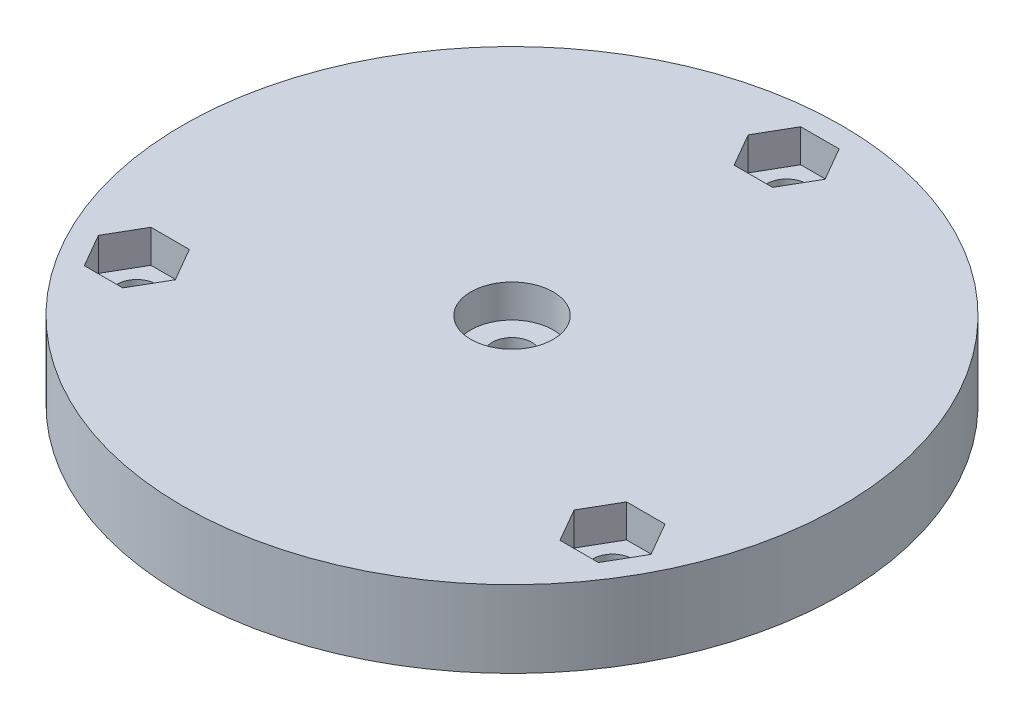
ISO-10303-21;
HEADER;
FILE_DESCRIPTION(('STEP AP214'),'2;1');
FILE_NAME('part.step','',(''),(''),'','','');
FILE_SCHEMA(('AUTOMOTIVE_DESIGN { 1 0 10303 214 1 1 1 1 }'));
ENDSEC;
DATA;
#1=APPLICATION_CONTEXT('core data for automotive mechanical design processes');
#2=APPLICATION_PROTOCOL_DEFINITION('international standard','automotive_design',2000,#1);
#3=PRODUCT_CONTEXT('',#1,'mechanical');
#4=PRODUCT('Part','Part','',(#3));
#5=PRODUCT_RELATED_PRODUCT_CATEGORY('part','',(#4));
#6=PRODUCT_DEFINITION_FORMATION('','',#4);
#7=PRODUCT_DEFINITION_CONTEXT('part definition',#1,'design');
#8=PRODUCT_DEFINITION('design','',#6,#7);
#9=PRODUCT_DEFINITION_SHAPE('','',#8);
#10=(LENGTH_UNIT() NAMED_UNIT(*) SI_UNIT(.MILLI.,.METRE.));
#11=(NAMED_UNIT(*) PLANE_ANGLE_UNIT() SI_UNIT($,.RADIAN.));
#12=(NAMED_UNIT(*) SI_UNIT($,.STERADIAN.) SOLID_ANGLE_UNIT());
#13=UNCERTAINTY_MEASURE_WITH_UNIT(LENGTH_MEASURE(1.E-05),#10,'distance_accuracy_value','');
#14=(GEOMETRIC_REPRESENTATION_CONTEXT(3) GLOBAL_UNCERTAINTY_ASSIGNED_CONTEXT((#13)) GLOBAL_UNIT_ASSIGNED_CONTEXT((#10,
#11,#12)) REPRESENTATION_CONTEXT('',''));
#15=CARTESIAN_POINT('',(0.,0.,0.));
#16=DIRECTION('',(0.,0.,1.));
#17=DIRECTION('',(1.,0.,0.));
#18=AXIS2_PLACEMENT_3D('',#15,#16,#17);
#19=CARTESIAN_POINT('',(0.,7.,0.));
#20=DIRECTION('',(0.,-1.,0.));
#21=DIRECTION('',(0.,0.,-1.));
#22=AXIS2_PLACEMENT_3D('',#19,#20,#21);
#23=CYLINDRICAL_SURFACE('',#22,1.8);
#24=CARTESIAN_POINT('',(0.,0.,0.));
#25=DIRECTION('',(0.,1.,0.));
#26=DIRECTION('',(0.,0.,1.));
#27=AXIS2_PLACEMENT_3D('',#24,#25,#26);
#28=CIRCLE('',#27,1.8);
#29=CARTESIAN_POINT('',(0.,0.,1.8));
#30=VERTEX_POINT('',#29);
#31=EDGE_CURVE('E377',#30,#30,#28,.T.);
#32=ORIENTED_EDGE('',*,*,#31,.F.);
#33=EDGE_LOOP('',(#32));
#34=FACE_BOUND('',#33,.T.);
#35=CARTESIAN_POINT('',(0.,4.,0.));
#36=DIRECTION('',(0.,1.,0.));
#37=DIRECTION('',(0.,0.,1.));
#38=AXIS2_PLACEMENT_3D('',#35,#36,#37);
#39=CIRCLE('',#38,1.8);
#40=CARTESIAN_POINT('',(0.,4.,1.8));
#41=VERTEX_POINT('',#40);
#42=EDGE_CURVE('E47',#41,#41,#39,.T.);
#43=ORIENTED_EDGE('',*,*,#42,.T.);
#44=EDGE_LOOP('',(#43));
#45=FACE_BOUND('',#44,.T.);
#46=ADVANCED_FACE('F43',(#34,#45),#23,.F.);
#47=CARTESIAN_POINT('',(0.,7.,-25.));
#48=DIRECTION('',(0.,-1.,0.));
#49=DIRECTION('',(0.,0.,-1.));
#50=AXIS2_PLACEMENT_3D('',#47,#48,#49);
#51=CYLINDRICAL_SURFACE('',#50,1.8);
#52=CARTESIAN_POINT('',(0.,0.,-25.));
#53=DIRECTION('',(0.,1.,0.));
#54=DIRECTION('',(0.,0.,1.));
#55=AXIS2_PLACEMENT_3D('',#52,#53,#54);
#56=CIRCLE('',#55,1.8);
#57=CARTESIAN_POINT('',(0.,0.,-23.2));
#58=VERTEX_POINT('',#57);
#59=EDGE_CURVE('E373',#58,#58,#56,.T.);
#60=ORIENTED_EDGE('',*,*,#59,.F.);
#61=EDGE_LOOP('',(#60));
#62=FACE_BOUND('',#61,.T.);
#63=CARTESIAN_POINT('',(0.,4.,-25.));
#64=DIRECTION('',(0.,1.,0.));
#65=DIRECTION('',(0.,0.,1.));
#66=AXIS2_PLACEMENT_3D('',#63,#64,#65);
#67=CIRCLE('',#66,1.8);
#68=CARTESIAN_POINT('',(0.,4.,-23.2));
#69=VERTEX_POINT('',#68);
#70=EDGE_CURVE('E390',#69,#69,#67,.T.);
#71=ORIENTED_EDGE('',*,*,#70,.T.);
#72=EDGE_LOOP('',(#71));
#73=FACE_BOUND('',#72,.T.);
#74=ADVANCED_FACE('F500',(#62,#73),#51,.F.);
#75=CARTESIAN_POINT('',(21.650635094611,7.,12.5));
#76=DIRECTION('',(0.,-1.,0.));
#77=DIRECTION('',(0.,0.,-1.));
#78=AXIS2_PLACEMENT_3D('',#75,#76,#77);
#79=CYLINDRICAL_SURFACE('',#78,1.8);
#80=CARTESIAN_POINT('',(21.650635094611,0.,12.5));
#81=DIRECTION('',(0.,1.,0.));
#82=DIRECTION('',(0.,0.,1.));
#83=AXIS2_PLACEMENT_3D('',#80,#81,#82);
#84=CIRCLE('',#83,1.8);
#85=CARTESIAN_POINT('',(21.650635094611,0.,14.3));
#86=VERTEX_POINT('',#85);
#87=EDGE_CURVE('E369',#86,#86,#84,.T.);
#88=ORIENTED_EDGE('',*,*,#87,.F.);
#89=EDGE_LOOP('',(#88));
#90=FACE_BOUND('',#89,.T.);
#91=CARTESIAN_POINT('',(21.650635094611,4.,12.5));
#92=DIRECTION('',(0.,1.,0.));
#93=DIRECTION('',(0.,0.,1.));
#94=AXIS2_PLACEMENT_3D('',#91,#92,#93);
#95=CIRCLE('',#94,1.8);
#96=CARTESIAN_POINT('',(21.650635094611,4.,14.3));
#97=VERTEX_POINT('',#96);
#98=EDGE_CURVE('E387',#97,#97,#95,.T.);
#99=ORIENTED_EDGE('',*,*,#98,.T.);
#100=EDGE_LOOP('',(#99));
#101=FACE_BOUND('',#100,.T.);
#102=ADVANCED_FACE('F437',(#90,#101),#79,.F.);
#103=CARTESIAN_POINT('',(-21.650635094611,7.,12.5));
#104=DIRECTION('',(0.,-1.,0.));
#105=DIRECTION('',(0.,0.,-1.));
#106=AXIS2_PLACEMENT_3D('',#103,#104,#105);
#107=CYLINDRICAL_SURFACE('',#106,1.8);
#108=CARTESIAN_POINT('',(-21.650635094611,0.,12.5));
#109=DIRECTION('',(0.,1.,0.));
#110=DIRECTION('',(0.,0.,1.));
#111=AXIS2_PLACEMENT_3D('',#108,#109,#110);
#112=CIRCLE('',#111,1.8);
#113=CARTESIAN_POINT('',(-21.650635094611,0.,14.3));
#114=VERTEX_POINT('',#113);
#115=EDGE_CURVE('E365',#114,#114,#112,.T.);
#116=ORIENTED_EDGE('',*,*,#115,.F.);
#117=EDGE_LOOP('',(#116));
#118=FACE_BOUND('',#117,.T.);
#119=CARTESIAN_POINT('',(-21.650635094611,4.,12.5));
#120=DIRECTION('',(0.,1.,0.));
#121=DIRECTION('',(0.,0.,1.));
#122=AXIS2_PLACEMENT_3D('',#119,#120,#121);
#123=CIRCLE('',#122,1.8);
#124=CARTESIAN_POINT('',(-21.650635094611,4.,14.3));
#125=VERTEX_POINT('',#124);
#126=EDGE_CURVE('E363',#125,#125,#123,.T.);
#127=ORIENTED_EDGE('',*,*,#126,.T.);
#128=EDGE_LOOP('',(#127));
#129=FACE_BOUND('',#128,.T.);
#130=ADVANCED_FACE('F415',(#118,#129),#107,.F.);
#131=CARTESIAN_POINT('',(0.,7.,0.));
#132=DIRECTION('',(0.,1.,0.));
#133=DIRECTION('',(0.,0.,1.));
#134=AXIS2_PLACEMENT_3D('',#131,#132,#133);
#135=PLANE('',#134);
#136=DIRECTION('',(-1.,0.,0.));
#137=VECTOR('',#136,1.);
#138=CARTESIAN_POINT('',(-19.900635094611,7.,9.46891108675447));
#139=LINE('',#138,#137);
#140=CARTESIAN_POINT('',(-19.900635094611,7.,9.46891108675447));
#141=VERTEX_POINT('',#140);
#142=CARTESIAN_POINT('',(-23.400635094611,7.,9.46891108675448));
#143=VERTEX_POINT('',#142);
#144=EDGE_CURVE('E61',#141,#143,#139,.T.);
#145=ORIENTED_EDGE('',*,*,#144,.F.);
#146=DIRECTION('',(-0.5,0.,-0.866025403784438));
#147=VECTOR('',#146,1.);
#148=CARTESIAN_POINT('',(-18.150635094611,7.,12.5));
#149=LINE('',#148,#147);
#150=CARTESIAN_POINT('',(-18.150635094611,7.,12.5));
#151=VERTEX_POINT('',#150);
#152=EDGE_CURVE('E316',#151,#141,#149,.T.);
#153=ORIENTED_EDGE('',*,*,#152,.F.);
#154=DIRECTION('',(0.5,0.,-0.866025403784439));
#155=VECTOR('',#154,1.);
#156=CARTESIAN_POINT('',(-19.900635094611,7.,15.5310889132456));
#157=LINE('',#156,#155);
#158=CARTESIAN_POINT('',(-19.900635094611,7.,15.5310889132456));
#159=VERTEX_POINT('',#158);
#160=EDGE_CURVE('E320',#159,#151,#157,.T.);
#161=ORIENTED_EDGE('',*,*,#160,.F.);
#162=DIRECTION('',(1.,0.,0.));
#163=VECTOR('',#162,1.);
#164=CARTESIAN_POINT('',(-23.400635094611,7.,15.5310889132456));
#165=LINE('',#164,#163);
#166=CARTESIAN_POINT('',(-23.400635094611,7.,15.5310889132456));
#167=VERTEX_POINT('',#166);
#168=EDGE_CURVE('E325',#167,#159,#165,.T.);
#169=ORIENTED_EDGE('',*,*,#168,.F.);
#170=DIRECTION('',(0.5,0.,0.866025403784439));
#171=VECTOR('',#170,1.);
#172=CARTESIAN_POINT('',(-25.150635094611,7.,12.5));
#173=LINE('',#172,#171);
#174=CARTESIAN_POINT('',(-25.150635094611,7.,12.5));
#175=VERTEX_POINT('',#174);
#176=EDGE_CURVE('E329',#175,#167,#173,.T.);
#177=ORIENTED_EDGE('',*,*,#176,.F.);
#178=DIRECTION('',(-0.5,0.,0.866025403784439));
#179=VECTOR('',#178,1.);
#180=CARTESIAN_POINT('',(-23.400635094611,7.,9.46891108675447));
#181=LINE('',#180,#179);
#182=EDGE_CURVE('E333',#143,#175,#181,.T.);
#183=ORIENTED_EDGE('',*,*,#182,.F.);
#184=EDGE_LOOP('',(#145,#153,#161,#169,#177,#183));
#185=FACE_BOUND('',#184,.T.);
#186=DIRECTION('',(0.500000000000001,0.,0.866025403784438));
#187=VECTOR('',#186,1.);
#188=CARTESIAN_POINT('',(18.150635094611,7.,12.5));
#189=LINE('',#188,#187);
#190=CARTESIAN_POINT('',(18.150635094611,7.,12.5));
#191=VERTEX_POINT('',#190);
#192=CARTESIAN_POINT('',(19.900635094611,7.,15.5310889132455));
#193=VERTEX_POINT('',#192);
#194=EDGE_CURVE('E69',#191,#193,#189,.T.);
#195=ORIENTED_EDGE('',*,*,#194,.F.);
#196=DIRECTION('',(-0.5,0.,0.866025403784439));
#197=VECTOR('',#196,1.);
#198=CARTESIAN_POINT('',(19.900635094611,7.,9.46891108675445));
#199=LINE('',#198,#197);
#200=CARTESIAN_POINT('',(19.900635094611,7.,9.46891108675445));
#201=VERTEX_POINT('',#200);
#202=EDGE_CURVE('E252',#201,#191,#199,.T.);
#203=ORIENTED_EDGE('',*,*,#202,.F.);
#204=DIRECTION('',(-1.,0.,0.));
#205=VECTOR('',#204,1.);
#206=CARTESIAN_POINT('',(23.400635094611,7.,9.46891108675445));
#207=LINE('',#206,#205);
#208=CARTESIAN_POINT('',(23.400635094611,7.,9.46891108675445));
#209=VERTEX_POINT('',#208);
#210=EDGE_CURVE('E256',#209,#201,#207,.T.);
#211=ORIENTED_EDGE('',*,*,#210,.F.);
#212=DIRECTION('',(-0.5,0.,-0.866025403784439));
#213=VECTOR('',#212,1.);
#214=CARTESIAN_POINT('',(25.150635094611,7.,12.5));
#215=LINE('',#214,#213);
#216=CARTESIAN_POINT('',(25.150635094611,7.,12.5));
#217=VERTEX_POINT('',#216);
#218=EDGE_CURVE('E261',#217,#209,#215,.T.);
#219=ORIENTED_EDGE('',*,*,#218,.F.);
#220=DIRECTION('',(0.5,0.,-0.866025403784438));
#221=VECTOR('',#220,1.);
#222=CARTESIAN_POINT('',(23.400635094611,7.,15.5310889132455));
#223=LINE('',#222,#221);
#224=CARTESIAN_POINT('',(23.400635094611,7.,15.5310889132455));
#225=VERTEX_POINT('',#224);
#226=EDGE_CURVE('E265',#225,#217,#223,.T.);
#227=ORIENTED_EDGE('',*,*,#226,.F.);
#228=DIRECTION('',(1.,0.,0.));
#229=VECTOR('',#228,1.);
#230=CARTESIAN_POINT('',(19.900635094611,7.,15.5310889132455));
#231=LINE('',#230,#229);
#232=EDGE_CURVE('E269',#193,#225,#231,.T.);
#233=ORIENTED_EDGE('',*,*,#232,.F.);
#234=EDGE_LOOP('',(#195,#203,#211,#219,#227,#233));
#235=FACE_BOUND('',#234,.T.);
#236=DIRECTION('',(0.5,0.,-0.866025403784438));
#237=VECTOR('',#236,1.);
#238=CARTESIAN_POINT('',(1.75,7.,-21.9689110867545));
#239=LINE('',#238,#237);
#240=CARTESIAN_POINT('',(1.75,7.,-21.9689110867545));
#241=VERTEX_POINT('',#240);
#242=CARTESIAN_POINT('',(3.50000000000001,7.,-25.));
#243=VERTEX_POINT('',#242);
#244=EDGE_CURVE('E174',#241,#243,#239,.T.);
#245=ORIENTED_EDGE('',*,*,#244,.F.);
#246=DIRECTION('',(1.,0.,0.));
#247=VECTOR('',#246,1.);
#248=CARTESIAN_POINT('',(-1.75000000000001,7.,-21.9689110867545));
#249=LINE('',#248,#247);
#250=CARTESIAN_POINT('',(-1.75000000000001,7.,-21.9689110867545));
#251=VERTEX_POINT('',#250);
#252=EDGE_CURVE('E185',#251,#241,#249,.T.);
#253=ORIENTED_EDGE('',*,*,#252,.F.);
#254=DIRECTION('',(0.5,0.,0.866025403784439));
#255=VECTOR('',#254,1.);
#256=CARTESIAN_POINT('',(-3.50000000000001,7.,-25.));
#257=LINE('',#256,#255);
#258=CARTESIAN_POINT('',(-3.50000000000001,7.,-25.));
#259=VERTEX_POINT('',#258);
#260=EDGE_CURVE('E191',#259,#251,#257,.T.);
#261=ORIENTED_EDGE('',*,*,#260,.F.);
#262=DIRECTION('',(-0.5,0.,0.866025403784439));
#263=VECTOR('',#262,1.);
#264=CARTESIAN_POINT('',(-1.75000000000001,7.,-28.0310889132455));
#265=LINE('',#264,#263);
#266=CARTESIAN_POINT('',(-1.75000000000001,7.,-28.0310889132455));
#267=VERTEX_POINT('',#266);
#268=EDGE_CURVE('E806',#267,#259,#265,.T.);
#269=ORIENTED_EDGE('',*,*,#268,.F.);
#270=DIRECTION('',(-1.,0.,0.));
#271=VECTOR('',#270,1.);
#272=CARTESIAN_POINT('',(1.75,7.,-28.0310889132455));
#273=LINE('',#272,#271);
#274=CARTESIAN_POINT('',(1.75,7.,-28.0310889132455));
#275=VERTEX_POINT('',#274);
#276=EDGE_CURVE('E207',#275,#267,#273,.T.);
#277=ORIENTED_EDGE('',*,*,#276,.F.);
#278=DIRECTION('',(-0.5,0.,-0.866025403784438));
#279=VECTOR('',#278,1.);
#280=CARTESIAN_POINT('',(3.5,7.,-25.));
#281=LINE('',#280,#279);
#282=EDGE_CURVE('E198',#243,#275,#281,.T.);
#283=ORIENTED_EDGE('',*,*,#282,.F.);
#284=EDGE_LOOP('',(#245,#253,#261,#269,#277,#283));
#285=FACE_BOUND('',#284,.T.);
#286=CARTESIAN_POINT('',(0.,7.,0.));
#287=DIRECTION('',(0.,1.,0.));
#288=DIRECTION('',(0.,0.,1.));
#289=AXIS2_PLACEMENT_3D('',#286,#287,#288);
#290=CIRCLE('',#289,3.75);
#291=CARTESIAN_POINT('',(0.,7.,3.75));
#292=VERTEX_POINT('',#291);
#293=EDGE_CURVE('E200',#292,#292,#290,.T.);
#294=ORIENTED_EDGE('',*,*,#293,.F.);
#295=EDGE_LOOP('',(#294));
#296=FACE_BOUND('',#295,.T.);
#297=CARTESIAN_POINT('',(0.,7.,0.));
#298=DIRECTION('',(0.,1.,0.));
#299=DIRECTION('',(0.,0.,1.));
#300=AXIS2_PLACEMENT_3D('',#297,#298,#299);
#301=CIRCLE('',#300,30.);
#302=CARTESIAN_POINT('',(0.,7.,30.));
#303=VERTEX_POINT('',#302);
#304=EDGE_CURVE('E11',#303,#303,#301,.T.);
#305=ORIENTED_EDGE('',*,*,#304,.T.);
#306=EDGE_LOOP('',(#305));
#307=FACE_BOUND('',#306,.T.);
#308=ADVANCED_FACE('F194',(#185,#235,#285,#296,#307),#135,.T.);
#309=CARTESIAN_POINT('',(0.,0.,0.));
#310=DIRECTION('',(0.,1.,0.));
#311=DIRECTION('',(0.,0.,1.));
#312=AXIS2_PLACEMENT_3D('',#309,#310,#311);
#313=PLANE('',#312);
#314=CARTESIAN_POINT('',(0.,0.,0.));
#315=DIRECTION('',(0.,1.,0.));
#316=DIRECTION('',(0.,0.,1.));
#317=AXIS2_PLACEMENT_3D('',#314,#315,#316);
#318=CIRCLE('',#317,30.);
#319=CARTESIAN_POINT('',(0.,0.,30.));
#320=VERTEX_POINT('',#319);
#321=EDGE_CURVE('E53',#320,#320,#318,.T.);
#322=ORIENTED_EDGE('',*,*,#321,.F.);
#323=EDGE_LOOP('',(#322));
#324=FACE_BOUND('',#323,.T.);
#325=ORIENTED_EDGE('',*,*,#31,.T.);
#326=EDGE_LOOP('',(#325));
#327=FACE_BOUND('',#326,.T.);
#328=ORIENTED_EDGE('',*,*,#59,.T.);
#329=EDGE_LOOP('',(#328));
#330=FACE_BOUND('',#329,.T.);
#331=ORIENTED_EDGE('',*,*,#87,.T.);
#332=EDGE_LOOP('',(#331));
#333=FACE_BOUND('',#332,.T.);
#334=ORIENTED_EDGE('',*,*,#115,.T.);
#335=EDGE_LOOP('',(#334));
#336=FACE_BOUND('',#335,.T.);
#337=ADVANCED_FACE('F414',(#324,#327,#330,#333,#336),#313,.F.);
#338=CARTESIAN_POINT('',(0.,7.,0.));
#339=DIRECTION('',(0.,-1.,0.));
#340=DIRECTION('',(0.,0.,-1.));
#341=AXIS2_PLACEMENT_3D('',#338,#339,#340);
#342=CYLINDRICAL_SURFACE('',#341,30.);
#343=ORIENTED_EDGE('',*,*,#304,.F.);
#344=EDGE_LOOP('',(#343));
#345=FACE_BOUND('',#344,.T.);
#346=ORIENTED_EDGE('',*,*,#321,.T.);
#347=EDGE_LOOP('',(#346));
#348=FACE_BOUND('',#347,.T.);
#349=ADVANCED_FACE('F45',(#345,#348),#342,.T.);
#350=CARTESIAN_POINT('',(-19.900635094611,4.,9.46891108675447));
#351=DIRECTION('',(0.,0.,-1.));
#352=DIRECTION('',(-1.,0.,0.));
#353=AXIS2_PLACEMENT_3D('',#350,#351,#352);
#354=PLANE('',#353);
#355=ORIENTED_EDGE('',*,*,#144,.T.);
#356=DIRECTION('',(0.,1.,0.));
#357=VECTOR('',#356,1.);
#358=CARTESIAN_POINT('',(-23.400635094611,4.,9.46891108675447));
#359=LINE('',#358,#357);
#360=CARTESIAN_POINT('',(-23.400635094611,4.,9.46891108675447));
#361=VERTEX_POINT('',#360);
#362=EDGE_CURVE('E297',#361,#143,#359,.T.);
#363=ORIENTED_EDGE('',*,*,#362,.F.);
#364=DIRECTION('',(-1.,0.,0.));
#365=VECTOR('',#364,1.);
#366=CARTESIAN_POINT('',(-19.900635094611,4.,9.46891108675447));
#367=LINE('',#366,#365);
#368=CARTESIAN_POINT('',(-19.900635094611,4.,9.46891108675447));
#369=VERTEX_POINT('',#368);
#370=EDGE_CURVE('E321',#369,#361,#367,.T.);
#371=ORIENTED_EDGE('',*,*,#370,.F.);
#372=DIRECTION('',(0.,1.,0.));
#373=VECTOR('',#372,1.);
#374=CARTESIAN_POINT('',(-19.900635094611,4.,9.46891108675447));
#375=LINE('',#374,#373);
#376=EDGE_CURVE('E313',#369,#141,#375,.T.);
#377=ORIENTED_EDGE('',*,*,#376,.T.);
#378=EDGE_LOOP('',(#355,#363,#371,#377));
#379=FACE_BOUND('',#378,.T.);
#380=ADVANCED_FACE('F422',(#379),#354,.F.);
#381=CARTESIAN_POINT('',(-18.150635094611,4.,12.5));
#382=DIRECTION('',(0.866025403784438,0.,-0.5));
#383=DIRECTION('',(-0.5,0.,-0.866025403784439));
#384=AXIS2_PLACEMENT_3D('',#381,#382,#383);
#385=PLANE('',#384);
#386=ORIENTED_EDGE('',*,*,#152,.T.);
#387=ORIENTED_EDGE('',*,*,#376,.F.);
#388=DIRECTION('',(-0.5,0.,-0.866025403784438));
#389=VECTOR('',#388,1.);
#390=CARTESIAN_POINT('',(-18.150635094611,4.,12.5));
#391=LINE('',#390,#389);
#392=CARTESIAN_POINT('',(-18.150635094611,4.,12.5));
#393=VERTEX_POINT('',#392);
#394=EDGE_CURVE('E300',#393,#369,#391,.T.);
#395=ORIENTED_EDGE('',*,*,#394,.F.);
#396=DIRECTION('',(0.,1.,0.));
#397=VECTOR('',#396,1.);
#398=CARTESIAN_POINT('',(-18.150635094611,4.,12.5));
#399=LINE('',#398,#397);
#400=EDGE_CURVE('E310',#393,#151,#399,.T.);
#401=ORIENTED_EDGE('',*,*,#400,.T.);
#402=EDGE_LOOP('',(#386,#387,#395,#401));
#403=FACE_BOUND('',#402,.T.);
#404=ADVANCED_FACE('F466',(#403),#385,.F.);
#405=CARTESIAN_POINT('',(-19.900635094611,4.,15.5310889132456));
#406=DIRECTION('',(0.866025403784439,0.,0.5));
#407=DIRECTION('',(0.5,0.,-0.866025403784439));
#408=AXIS2_PLACEMENT_3D('',#405,#406,#407);
#409=PLANE('',#408);
#410=ORIENTED_EDGE('',*,*,#160,.T.);
#411=ORIENTED_EDGE('',*,*,#400,.F.);
#412=DIRECTION('',(0.5,0.,-0.866025403784439));
#413=VECTOR('',#412,1.);
#414=CARTESIAN_POINT('',(-19.900635094611,4.,15.5310889132456));
#415=LINE('',#414,#413);
#416=CARTESIAN_POINT('',(-19.900635094611,4.,15.5310889132456));
#417=VERTEX_POINT('',#416);
#418=EDGE_CURVE('E342',#417,#393,#415,.T.);
#419=ORIENTED_EDGE('',*,*,#418,.F.);
#420=DIRECTION('',(0.,1.,0.));
#421=VECTOR('',#420,1.);
#422=CARTESIAN_POINT('',(-19.900635094611,4.,15.5310889132456));
#423=LINE('',#422,#421);
#424=EDGE_CURVE('E307',#417,#159,#423,.T.);
#425=ORIENTED_EDGE('',*,*,#424,.T.);
#426=EDGE_LOOP('',(#410,#411,#419,#425));
#427=FACE_BOUND('',#426,.T.);
#428=ADVANCED_FACE('F463',(#427),#409,.F.);
#429=CARTESIAN_POINT('',(-23.400635094611,4.,15.5310889132456));
#430=DIRECTION('',(0.,0.,1.));
#431=DIRECTION('',(1.,0.,0.));
#432=AXIS2_PLACEMENT_3D('',#429,#430,#431);
#433=PLANE('',#432);
#434=ORIENTED_EDGE('',*,*,#168,.T.);
#435=ORIENTED_EDGE('',*,*,#424,.F.);
#436=DIRECTION('',(1.,0.,0.));
#437=VECTOR('',#436,1.);
#438=CARTESIAN_POINT('',(-23.400635094611,4.,15.5310889132456));
#439=LINE('',#438,#437);
#440=CARTESIAN_POINT('',(-23.400635094611,4.,15.5310889132456));
#441=VERTEX_POINT('',#440);
#442=EDGE_CURVE('E346',#441,#417,#439,.T.);
#443=ORIENTED_EDGE('',*,*,#442,.F.);
#444=DIRECTION('',(0.,1.,0.));
#445=VECTOR('',#444,1.);
#446=CARTESIAN_POINT('',(-23.400635094611,4.,15.5310889132456));
#447=LINE('',#446,#445);
#448=EDGE_CURVE('E304',#441,#167,#447,.T.);
#449=ORIENTED_EDGE('',*,*,#448,.T.);
#450=EDGE_LOOP('',(#434,#435,#443,#449));
#451=FACE_BOUND('',#450,.T.);
#452=ADVANCED_FACE('F459',(#451),#433,.F.);
#453=CARTESIAN_POINT('',(-25.150635094611,4.,12.5));
#454=DIRECTION('',(-0.866025403784439,0.,0.5));
#455=DIRECTION('',(0.5,0.,0.866025403784439));
#456=AXIS2_PLACEMENT_3D('',#453,#454,#455);
#457=PLANE('',#456);
#458=ORIENTED_EDGE('',*,*,#176,.T.);
#459=ORIENTED_EDGE('',*,*,#448,.F.);
#460=DIRECTION('',(0.5,0.,0.866025403784439));
#461=VECTOR('',#460,1.);
#462=CARTESIAN_POINT('',(-25.150635094611,4.,12.5));
#463=LINE('',#462,#461);
#464=CARTESIAN_POINT('',(-25.150635094611,4.,12.5));
#465=VERTEX_POINT('',#464);
#466=EDGE_CURVE('E350',#465,#441,#463,.T.);
#467=ORIENTED_EDGE('',*,*,#466,.F.);
#468=DIRECTION('',(0.,1.,0.));
#469=VECTOR('',#468,1.);
#470=CARTESIAN_POINT('',(-25.150635094611,4.,12.5));
#471=LINE('',#470,#469);
#472=EDGE_CURVE('E301',#465,#175,#471,.T.);
#473=ORIENTED_EDGE('',*,*,#472,.T.);
#474=EDGE_LOOP('',(#458,#459,#467,#473));
#475=FACE_BOUND('',#474,.T.);
#476=ADVANCED_FACE('F455',(#475),#457,.F.);
#477=CARTESIAN_POINT('',(-23.400635094611,4.,9.46891108675447));
#478=DIRECTION('',(-0.866025403784439,0.,-0.5));
#479=DIRECTION('',(-0.5,0.,0.866025403784439));
#480=AXIS2_PLACEMENT_3D('',#477,#478,#479);
#481=PLANE('',#480);
#482=ORIENTED_EDGE('',*,*,#182,.T.);
#483=ORIENTED_EDGE('',*,*,#472,.F.);
#484=DIRECTION('',(-0.5,0.,0.866025403784439));
#485=VECTOR('',#484,1.);
#486=CARTESIAN_POINT('',(-23.400635094611,4.,9.46891108675447));
#487=LINE('',#486,#485);
#488=EDGE_CURVE('E354',#361,#465,#487,.T.);
#489=ORIENTED_EDGE('',*,*,#488,.F.);
#490=ORIENTED_EDGE('',*,*,#362,.T.);
#491=EDGE_LOOP('',(#482,#483,#489,#490));
#492=FACE_BOUND('',#491,.T.);
#493=ADVANCED_FACE('F445',(#492),#481,.F.);
#494=CARTESIAN_POINT('',(0.,4.,0.));
#495=DIRECTION('',(0.,1.,0.));
#496=DIRECTION('',(0.,0.,1.));
#497=AXIS2_PLACEMENT_3D('',#494,#495,#496);
#498=PLANE('',#497);
#499=ORIENTED_EDGE('',*,*,#126,.F.);
#500=EDGE_LOOP('',(#499));
#501=FACE_BOUND('',#500,.T.);
#502=ORIENTED_EDGE('',*,*,#370,.T.);
#503=ORIENTED_EDGE('',*,*,#488,.T.);
#504=ORIENTED_EDGE('',*,*,#466,.T.);
#505=ORIENTED_EDGE('',*,*,#442,.T.);
#506=ORIENTED_EDGE('',*,*,#418,.T.);
#507=ORIENTED_EDGE('',*,*,#394,.T.);
#508=EDGE_LOOP('',(#502,#503,#504,#505,#506,#507));
#509=FACE_BOUND('',#508,.T.);
#510=ADVANCED_FACE('F441',(#501,#509),#498,.T.);
#511=CARTESIAN_POINT('',(18.150635094611,4.,12.5));
#512=DIRECTION('',(-0.866025403784438,0.,0.500000000000001));
#513=DIRECTION('',(0.500000000000001,0.,0.866025403784438));
#514=AXIS2_PLACEMENT_3D('',#511,#512,#513);
#515=PLANE('',#514);
#516=ORIENTED_EDGE('',*,*,#194,.T.);
#517=DIRECTION('',(0.,1.,0.));
#518=VECTOR('',#517,1.);
#519=CARTESIAN_POINT('',(19.900635094611,4.,15.5310889132455));
#520=LINE('',#519,#518);
#521=CARTESIAN_POINT('',(19.900635094611,4.,15.5310889132455));
#522=VERTEX_POINT('',#521);
#523=EDGE_CURVE('E233',#522,#193,#520,.T.);
#524=ORIENTED_EDGE('',*,*,#523,.F.);
#525=DIRECTION('',(0.500000000000001,0.,0.866025403784438));
#526=VECTOR('',#525,1.);
#527=CARTESIAN_POINT('',(18.150635094611,4.,12.5));
#528=LINE('',#527,#526);
#529=CARTESIAN_POINT('',(18.150635094611,4.,12.5));
#530=VERTEX_POINT('',#529);
#531=EDGE_CURVE('E257',#530,#522,#528,.T.);
#532=ORIENTED_EDGE('',*,*,#531,.F.);
#533=DIRECTION('',(0.,1.,0.));
#534=VECTOR('',#533,1.);
#535=CARTESIAN_POINT('',(18.150635094611,4.,12.5));
#536=LINE('',#535,#534);
#537=EDGE_CURVE('E249',#530,#191,#536,.T.);
#538=ORIENTED_EDGE('',*,*,#537,.T.);
#539=EDGE_LOOP('',(#516,#524,#532,#538));
#540=FACE_BOUND('',#539,.T.);
#541=ADVANCED_FACE('F444',(#540),#515,.F.);
#542=CARTESIAN_POINT('',(19.900635094611,4.,9.46891108675445));
#543=DIRECTION('',(-0.866025403784438,0.,-0.5));
#544=DIRECTION('',(-0.5,0.,0.866025403784439));
#545=AXIS2_PLACEMENT_3D('',#542,#543,#544);
#546=PLANE('',#545);
#547=ORIENTED_EDGE('',*,*,#202,.T.);
#548=ORIENTED_EDGE('',*,*,#537,.F.);
#549=DIRECTION('',(-0.5,0.,0.866025403784439));
#550=VECTOR('',#549,1.);
#551=CARTESIAN_POINT('',(19.900635094611,4.,9.46891108675445));
#552=LINE('',#551,#550);
#553=CARTESIAN_POINT('',(19.900635094611,4.,9.46891108675445));
#554=VERTEX_POINT('',#553);
#555=EDGE_CURVE('E236',#554,#530,#552,.T.);
#556=ORIENTED_EDGE('',*,*,#555,.F.);
#557=DIRECTION('',(0.,1.,0.));
#558=VECTOR('',#557,1.);
#559=CARTESIAN_POINT('',(19.900635094611,4.,9.46891108675445));
#560=LINE('',#559,#558);
#561=EDGE_CURVE('E246',#554,#201,#560,.T.);
#562=ORIENTED_EDGE('',*,*,#561,.T.);
#563=EDGE_LOOP('',(#547,#548,#556,#562));
#564=FACE_BOUND('',#563,.T.);
#565=ADVANCED_FACE('F483',(#564),#546,.F.);
#566=CARTESIAN_POINT('',(23.400635094611,4.,9.46891108675445));
#567=DIRECTION('',(0.,0.,-1.));
#568=DIRECTION('',(-1.,0.,0.));
#569=AXIS2_PLACEMENT_3D('',#566,#567,#568);
#570=PLANE('',#569);
#571=ORIENTED_EDGE('',*,*,#210,.T.);
#572=ORIENTED_EDGE('',*,*,#561,.F.);
#573=DIRECTION('',(-1.,0.,0.));
#574=VECTOR('',#573,1.);
#575=CARTESIAN_POINT('',(23.400635094611,4.,9.46891108675445));
#576=LINE('',#575,#574);
#577=CARTESIAN_POINT('',(23.400635094611,4.,9.46891108675445));
#578=VERTEX_POINT('',#577);
#579=EDGE_CURVE('E278',#578,#554,#576,.T.);
#580=ORIENTED_EDGE('',*,*,#579,.F.);
#581=DIRECTION('',(0.,1.,0.));
#582=VECTOR('',#581,1.);
#583=CARTESIAN_POINT('',(23.400635094611,4.,9.46891108675445));
#584=LINE('',#583,#582);
#585=EDGE_CURVE('E243',#578,#209,#584,.T.);
#586=ORIENTED_EDGE('',*,*,#585,.T.);
#587=EDGE_LOOP('',(#571,#572,#580,#586));
#588=FACE_BOUND('',#587,.T.);
#589=ADVANCED_FACE('F485',(#588),#570,.F.);
#590=CARTESIAN_POINT('',(25.150635094611,4.,12.5));
#591=DIRECTION('',(0.866025403784439,0.,-0.5));
#592=DIRECTION('',(-0.5,0.,-0.866025403784439));
#593=AXIS2_PLACEMENT_3D('',#590,#591,#592);
#594=PLANE('',#593);
#595=ORIENTED_EDGE('',*,*,#218,.T.);
#596=ORIENTED_EDGE('',*,*,#585,.F.);
#597=DIRECTION('',(-0.5,0.,-0.866025403784439));
#598=VECTOR('',#597,1.);
#599=CARTESIAN_POINT('',(25.150635094611,4.,12.5));
#600=LINE('',#599,#598);
#601=CARTESIAN_POINT('',(25.150635094611,4.,12.5));
#602=VERTEX_POINT('',#601);
#603=EDGE_CURVE('E282',#602,#578,#600,.T.);
#604=ORIENTED_EDGE('',*,*,#603,.F.);
#605=DIRECTION('',(0.,1.,0.));
#606=VECTOR('',#605,1.);
#607=CARTESIAN_POINT('',(25.150635094611,4.,12.5));
#608=LINE('',#607,#606);
#609=EDGE_CURVE('E240',#602,#217,#608,.T.);
#610=ORIENTED_EDGE('',*,*,#609,.T.);
#611=EDGE_LOOP('',(#595,#596,#604,#610));
#612=FACE_BOUND('',#611,.T.);
#613=ADVANCED_FACE('F487',(#612),#594,.F.);
#614=CARTESIAN_POINT('',(23.400635094611,4.,15.5310889132455));
#615=DIRECTION('',(0.866025403784438,0.,0.5));
#616=DIRECTION('',(0.5,0.,-0.866025403784439));
#617=AXIS2_PLACEMENT_3D('',#614,#615,#616);
#618=PLANE('',#617);
#619=ORIENTED_EDGE('',*,*,#226,.T.);
#620=ORIENTED_EDGE('',*,*,#609,.F.);
#621=DIRECTION('',(0.5,0.,-0.866025403784438));
#622=VECTOR('',#621,1.);
#623=CARTESIAN_POINT('',(23.400635094611,4.,15.5310889132455));
#624=LINE('',#623,#622);
#625=CARTESIAN_POINT('',(23.400635094611,4.,15.5310889132455));
#626=VERTEX_POINT('',#625);
#627=EDGE_CURVE('E286',#626,#602,#624,.T.);
#628=ORIENTED_EDGE('',*,*,#627,.F.);
#629=DIRECTION('',(0.,1.,0.));
#630=VECTOR('',#629,1.);
#631=CARTESIAN_POINT('',(23.400635094611,4.,15.5310889132455));
#632=LINE('',#631,#630);
#633=EDGE_CURVE('E237',#626,#225,#632,.T.);
#634=ORIENTED_EDGE('',*,*,#633,.T.);
#635=EDGE_LOOP('',(#619,#620,#628,#634));
#636=FACE_BOUND('',#635,.T.);
#637=ADVANCED_FACE('F490',(#636),#618,.F.);
#638=CARTESIAN_POINT('',(19.900635094611,4.,15.5310889132455));
#639=DIRECTION('',(0.,0.,1.));
#640=DIRECTION('',(1.,0.,0.));
#641=AXIS2_PLACEMENT_3D('',#638,#639,#640);
#642=PLANE('',#641);
#643=ORIENTED_EDGE('',*,*,#232,.T.);
#644=ORIENTED_EDGE('',*,*,#633,.F.);
#645=DIRECTION('',(1.,0.,0.));
#646=VECTOR('',#645,1.);
#647=CARTESIAN_POINT('',(19.900635094611,4.,15.5310889132455));
#648=LINE('',#647,#646);
#649=EDGE_CURVE('E290',#522,#626,#648,.T.);
#650=ORIENTED_EDGE('',*,*,#649,.F.);
#651=ORIENTED_EDGE('',*,*,#523,.T.);
#652=EDGE_LOOP('',(#643,#644,#650,#651));
#653=FACE_BOUND('',#652,.T.);
#654=ADVANCED_FACE('F474',(#653),#642,.F.);
#655=CARTESIAN_POINT('',(0.,4.,0.));
#656=DIRECTION('',(0.,1.,0.));
#657=DIRECTION('',(0.,0.,1.));
#658=AXIS2_PLACEMENT_3D('',#655,#656,#657);
#659=PLANE('',#658);
#660=ORIENTED_EDGE('',*,*,#98,.F.);
#661=EDGE_LOOP('',(#660));
#662=FACE_BOUND('',#661,.T.);
#663=ORIENTED_EDGE('',*,*,#531,.T.);
#664=ORIENTED_EDGE('',*,*,#649,.T.);
#665=ORIENTED_EDGE('',*,*,#627,.T.);
#666=ORIENTED_EDGE('',*,*,#603,.T.);
#667=ORIENTED_EDGE('',*,*,#579,.T.);
#668=ORIENTED_EDGE('',*,*,#555,.T.);
#669=EDGE_LOOP('',(#663,#664,#665,#666,#667,#668));
#670=FACE_BOUND('',#669,.T.);
#671=ADVANCED_FACE('F480',(#662,#670),#659,.T.);
#672=CARTESIAN_POINT('',(1.75,4.,-21.9689110867545));
#673=DIRECTION('',(0.866025403784439,0.,0.5));
#674=DIRECTION('',(0.5,0.,-0.866025403784439));
#675=AXIS2_PLACEMENT_3D('',#672,#673,#674);
#676=PLANE('',#675);
#677=ORIENTED_EDGE('',*,*,#244,.T.);
#678=DIRECTION('',(0.,1.,0.));
#679=VECTOR('',#678,1.);
#680=CARTESIAN_POINT('',(3.5,4.,-25.));
#681=LINE('',#680,#679);
#682=CARTESIAN_POINT('',(3.5,4.,-25.));
#683=VERTEX_POINT('',#682);
#684=EDGE_CURVE('E215',#683,#243,#681,.T.);
#685=ORIENTED_EDGE('',*,*,#684,.F.);
#686=DIRECTION('',(0.5,0.,-0.866025403784438));
#687=VECTOR('',#686,1.);
#688=CARTESIAN_POINT('',(1.75,4.,-21.9689110867545));
#689=LINE('',#688,#687);
#690=CARTESIAN_POINT('',(1.75,4.,-21.9689110867545));
#691=VERTEX_POINT('',#690);
#692=EDGE_CURVE('E177',#691,#683,#689,.T.);
#693=ORIENTED_EDGE('',*,*,#692,.F.);
#694=DIRECTION('',(0.,1.,0.));
#695=VECTOR('',#694,1.);
#696=CARTESIAN_POINT('',(1.75,4.,-21.9689110867545));
#697=LINE('',#696,#695);
#698=EDGE_CURVE('E170',#691,#241,#697,.T.);
#699=ORIENTED_EDGE('',*,*,#698,.T.);
#700=EDGE_LOOP('',(#677,#685,#693,#699));
#701=FACE_BOUND('',#700,.T.);
#702=ADVANCED_FACE('F172',(#701),#676,.F.);
#703=CARTESIAN_POINT('',(-1.75000000000001,4.,-21.9689110867545));
#704=DIRECTION('',(0.,0.,1.));
#705=DIRECTION('',(1.,0.,0.));
#706=AXIS2_PLACEMENT_3D('',#703,#704,#705);
#707=PLANE('',#706);
#708=ORIENTED_EDGE('',*,*,#252,.T.);
#709=ORIENTED_EDGE('',*,*,#698,.F.);
#710=DIRECTION('',(1.,0.,0.));
#711=VECTOR('',#710,1.);
#712=CARTESIAN_POINT('',(-1.75000000000001,4.,-21.9689110867545));
#713=LINE('',#712,#711);
#714=CARTESIAN_POINT('',(-1.75000000000001,4.,-21.9689110867545));
#715=VERTEX_POINT('',#714);
#716=EDGE_CURVE('E211',#715,#691,#713,.T.);
#717=ORIENTED_EDGE('',*,*,#716,.F.);
#718=DIRECTION('',(0.,1.,0.));
#719=VECTOR('',#718,1.);
#720=CARTESIAN_POINT('',(-1.75000000000001,4.,-21.9689110867545));
#721=LINE('',#720,#719);
#722=EDGE_CURVE('E182',#715,#251,#721,.T.);
#723=ORIENTED_EDGE('',*,*,#722,.T.);
#724=EDGE_LOOP('',(#708,#709,#717,#723));
#725=FACE_BOUND('',#724,.T.);
#726=ADVANCED_FACE('F186',(#725),#707,.F.);
#727=CARTESIAN_POINT('',(-3.50000000000001,4.,-25.));
#728=DIRECTION('',(-0.866025403784439,0.,0.5));
#729=DIRECTION('',(0.5,0.,0.866025403784439));
#730=AXIS2_PLACEMENT_3D('',#727,#728,#729);
#731=PLANE('',#730);
#732=ORIENTED_EDGE('',*,*,#260,.T.);
#733=ORIENTED_EDGE('',*,*,#722,.F.);
#734=DIRECTION('',(0.5,0.,0.866025403784439));
#735=VECTOR('',#734,1.);
#736=CARTESIAN_POINT('',(-3.50000000000001,4.,-25.));
#737=LINE('',#736,#735);
#738=CARTESIAN_POINT('',(-3.50000000000001,4.,-25.));
#739=VERTEX_POINT('',#738);
#740=EDGE_CURVE('E214',#739,#715,#737,.T.);
#741=ORIENTED_EDGE('',*,*,#740,.F.);
#742=DIRECTION('',(0.,1.,0.));
#743=VECTOR('',#742,1.);
#744=CARTESIAN_POINT('',(-3.50000000000001,4.,-25.));
#745=LINE('',#744,#743);
#746=EDGE_CURVE('E795',#739,#259,#745,.T.);
#747=ORIENTED_EDGE('',*,*,#746,.T.);
#748=EDGE_LOOP('',(#732,#733,#741,#747));
#749=FACE_BOUND('',#748,.T.);
#750=ADVANCED_FACE('F577',(#749),#731,.F.);
#751=CARTESIAN_POINT('',(-1.75000000000001,4.,-28.0310889132455));
#752=DIRECTION('',(-0.866025403784439,0.,-0.5));
#753=DIRECTION('',(-0.5,0.,0.866025403784439));
#754=AXIS2_PLACEMENT_3D('',#751,#752,#753);
#755=PLANE('',#754);
#756=ORIENTED_EDGE('',*,*,#268,.T.);
#757=ORIENTED_EDGE('',*,*,#746,.F.);
#758=DIRECTION('',(-0.5,0.,0.866025403784439));
#759=VECTOR('',#758,1.);
#760=CARTESIAN_POINT('',(-1.75000000000001,4.,-28.0310889132455));
#761=LINE('',#760,#759);
#762=CARTESIAN_POINT('',(-1.75000000000001,4.,-28.0310889132455));
#763=VERTEX_POINT('',#762);
#764=EDGE_CURVE('E219',#763,#739,#761,.T.);
#765=ORIENTED_EDGE('',*,*,#764,.F.);
#766=DIRECTION('',(0.,1.,0.));
#767=VECTOR('',#766,1.);
#768=CARTESIAN_POINT('',(-1.75000000000001,4.,-28.0310889132455));
#769=LINE('',#768,#767);
#770=EDGE_CURVE('E800',#763,#267,#769,.T.);
#771=ORIENTED_EDGE('',*,*,#770,.T.);
#772=EDGE_LOOP('',(#756,#757,#765,#771));
#773=FACE_BOUND('',#772,.T.);
#774=ADVANCED_FACE('F587',(#773),#755,.F.);
#775=CARTESIAN_POINT('',(1.75,4.,-28.0310889132455));
#776=DIRECTION('',(0.,0.,-1.));
#777=DIRECTION('',(-1.,0.,0.));
#778=AXIS2_PLACEMENT_3D('',#775,#776,#777);
#779=PLANE('',#778);
#780=ORIENTED_EDGE('',*,*,#276,.T.);
#781=ORIENTED_EDGE('',*,*,#770,.F.);
#782=DIRECTION('',(-1.,0.,0.));
#783=VECTOR('',#782,1.);
#784=CARTESIAN_POINT('',(1.75,4.,-28.0310889132455));
#785=LINE('',#784,#783);
#786=CARTESIAN_POINT('',(1.75,4.,-28.0310889132455));
#787=VERTEX_POINT('',#786);
#788=EDGE_CURVE('E223',#787,#763,#785,.T.);
#789=ORIENTED_EDGE('',*,*,#788,.F.);
#790=DIRECTION('',(0.,1.,0.));
#791=VECTOR('',#790,1.);
#792=CARTESIAN_POINT('',(1.75,4.,-28.0310889132455));
#793=LINE('',#792,#791);
#794=EDGE_CURVE('E812',#787,#275,#793,.T.);
#795=ORIENTED_EDGE('',*,*,#794,.T.);
#796=EDGE_LOOP('',(#780,#781,#789,#795));
#797=FACE_BOUND('',#796,.T.);
#798=ADVANCED_FACE('F598',(#797),#779,.F.);
#799=CARTESIAN_POINT('',(3.5,4.,-25.));
#800=DIRECTION('',(0.866025403784438,0.,-0.5));
#801=DIRECTION('',(-0.5,0.,-0.866025403784438));
#802=AXIS2_PLACEMENT_3D('',#799,#800,#801);
#803=PLANE('',#802);
#804=ORIENTED_EDGE('',*,*,#282,.T.);
#805=ORIENTED_EDGE('',*,*,#794,.F.);
#806=DIRECTION('',(-0.5,0.,-0.866025403784438));
#807=VECTOR('',#806,1.);
#808=CARTESIAN_POINT('',(3.5,4.,-25.));
#809=LINE('',#808,#807);
#810=EDGE_CURVE('E227',#683,#787,#809,.T.);
#811=ORIENTED_EDGE('',*,*,#810,.F.);
#812=ORIENTED_EDGE('',*,*,#684,.T.);
#813=EDGE_LOOP('',(#804,#805,#811,#812));
#814=FACE_BOUND('',#813,.T.);
#815=ADVANCED_FACE('F609',(#814),#803,.F.);
#816=CARTESIAN_POINT('',(0.,4.,0.));
#817=DIRECTION('',(0.,1.,0.));
#818=DIRECTION('',(0.,0.,1.));
#819=AXIS2_PLACEMENT_3D('',#816,#817,#818);
#820=PLANE('',#819);
#821=ORIENTED_EDGE('',*,*,#70,.F.);
#822=EDGE_LOOP('',(#821));
#823=FACE_BOUND('',#822,.T.);
#824=ORIENTED_EDGE('',*,*,#692,.T.);
#825=ORIENTED_EDGE('',*,*,#810,.T.);
#826=ORIENTED_EDGE('',*,*,#788,.T.);
#827=ORIENTED_EDGE('',*,*,#764,.T.);
#828=ORIENTED_EDGE('',*,*,#740,.T.);
#829=ORIENTED_EDGE('',*,*,#716,.T.);
#830=EDGE_LOOP('',(#824,#825,#826,#827,#828,#829));
#831=FACE_BOUND('',#830,.T.);
#832=ADVANCED_FACE('F409',(#823,#831),#820,.T.);
#833=CARTESIAN_POINT('',(0.,4.,0.));
#834=DIRECTION('',(0.,1.,0.));
#835=DIRECTION('',(0.,0.,1.));
#836=AXIS2_PLACEMENT_3D('',#833,#834,#835);
#837=CYLINDRICAL_SURFACE('',#836,3.75);
#838=CARTESIAN_POINT('',(0.,4.,0.));
#839=DIRECTION('',(0.,1.,0.));
#840=DIRECTION('',(0.,0.,1.));
#841=AXIS2_PLACEMENT_3D('',#838,#839,#840);
#842=CIRCLE('',#841,3.75);
#843=CARTESIAN_POINT('',(0.,4.,3.75));
#844=VERTEX_POINT('',#843);
#845=EDGE_CURVE('E205',#844,#844,#842,.T.);
#846=ORIENTED_EDGE('',*,*,#845,.F.);
#847=EDGE_LOOP('',(#846));
#848=FACE_BOUND('',#847,.T.);
#849=ORIENTED_EDGE('',*,*,#293,.T.);
#850=EDGE_LOOP('',(#849));
#851=FACE_BOUND('',#850,.T.);
#852=ADVANCED_FACE('F403',(#848,#851),#837,.F.);
#853=CARTESIAN_POINT('',(0.,4.,0.));
#854=DIRECTION('',(0.,1.,0.));
#855=DIRECTION('',(0.,0.,1.));
#856=AXIS2_PLACEMENT_3D('',#853,#854,#855);
#857=PLANE('',#856);
#858=ORIENTED_EDGE('',*,*,#42,.F.);
#859=EDGE_LOOP('',(#858));
#860=FACE_BOUND('',#859,.T.);
#861=ORIENTED_EDGE('',*,*,#845,.T.);
#862=EDGE_LOOP('',(#861));
#863=FACE_BOUND('',#862,.T.);
#864=ADVANCED_FACE('F400',(#860,#863),#857,.T.);
#865=CLOSED_SHELL('',(#46,#74,#102,#130,#308,#337,#349,#380,#404,#428,#452,#476,#493,#510,#541,
#565,#589,#613,#637,#654,#671,#702,#726,#750,#774,#798,#815,#832,#852,#864));
#866=MANIFOLD_SOLID_BREP('B2',#865);
#867=ADVANCED_BREP_SHAPE_REPRESENTATION('',(#18,#866),#14);
#868=SHAPE_DEFINITION_REPRESENTATION(#9,#867);
ENDSEC;
END-ISO-10303-21;
